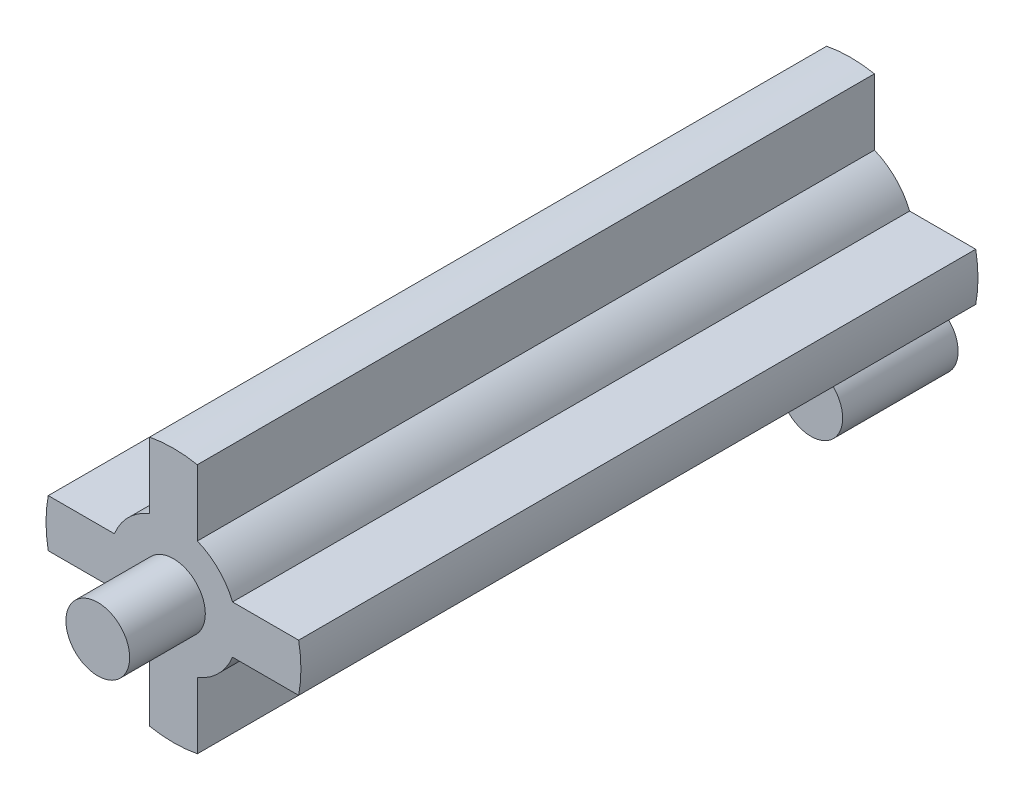
ISO-10303-21;
HEADER;
FILE_DESCRIPTION(('STEP AP214'),'2;1');
FILE_NAME('part.step','',(''),(''),'','','');
FILE_SCHEMA(('AUTOMOTIVE_DESIGN { 1 0 10303 214 1 1 1 1 }'));
ENDSEC;
DATA;
#1=APPLICATION_CONTEXT('core data for automotive mechanical design processes');
#2=APPLICATION_PROTOCOL_DEFINITION('international standard','automotive_design',2000,#1);
#3=PRODUCT_CONTEXT('',#1,'mechanical');
#4=PRODUCT('Part','Part','',(#3));
#5=PRODUCT_RELATED_PRODUCT_CATEGORY('part','',(#4));
#6=PRODUCT_DEFINITION_FORMATION('','',#4);
#7=PRODUCT_DEFINITION_CONTEXT('part definition',#1,'design');
#8=PRODUCT_DEFINITION('design','',#6,#7);
#9=PRODUCT_DEFINITION_SHAPE('','',#8);
#10=(LENGTH_UNIT() NAMED_UNIT(*) SI_UNIT(.MILLI.,.METRE.));
#11=(NAMED_UNIT(*) PLANE_ANGLE_UNIT() SI_UNIT($,.RADIAN.));
#12=(NAMED_UNIT(*) SI_UNIT($,.STERADIAN.) SOLID_ANGLE_UNIT());
#13=UNCERTAINTY_MEASURE_WITH_UNIT(LENGTH_MEASURE(1.E-05),#10,'distance_accuracy_value','');
#14=(GEOMETRIC_REPRESENTATION_CONTEXT(3) GLOBAL_UNCERTAINTY_ASSIGNED_CONTEXT((#13)) GLOBAL_UNIT_ASSIGNED_CONTEXT((#10,
#11,#12)) REPRESENTATION_CONTEXT('',''));
#15=CARTESIAN_POINT('',(0.,0.,0.));
#16=DIRECTION('',(0.,0.,1.));
#17=DIRECTION('',(1.,0.,0.));
#18=AXIS2_PLACEMENT_3D('',#15,#16,#17);
#19=CARTESIAN_POINT('',(9.53294491023637,-9.21867200110799,14.5));
#20=DIRECTION('',(0.,0.,-1.));
#21=DIRECTION('',(-1.,0.,0.));
#22=AXIS2_PLACEMENT_3D('',#19,#20,#21);
#23=CYLINDRICAL_SURFACE('',#22,3.975);
#24=CARTESIAN_POINT('',(9.53294491023637,-9.21867200110799,14.5));
#25=DIRECTION('',(0.,0.,1.));
#26=DIRECTION('',(1.,0.,0.));
#27=AXIS2_PLACEMENT_3D('',#24,#25,#26);
#28=CIRCLE('',#27,3.975);
#29=CARTESIAN_POINT('',(13.5079449102364,-9.21867200110799,14.5));
#30=VERTEX_POINT('',#29);
#31=EDGE_CURVE('E12',#30,#30,#28,.T.);
#32=ORIENTED_EDGE('',*,*,#31,.F.);
#33=EDGE_LOOP('',(#32));
#34=FACE_BOUND('',#33,.T.);
#35=CARTESIAN_POINT('',(9.53294491023637,-9.21867200110799,0.));
#36=DIRECTION('',(0.,0.,1.));
#37=DIRECTION('',(1.,0.,0.));
#38=AXIS2_PLACEMENT_3D('',#35,#36,#37);
#39=CIRCLE('',#38,3.975);
#40=CARTESIAN_POINT('',(13.5079449102364,-9.21867200110799,0.));
#41=VERTEX_POINT('',#40);
#42=EDGE_CURVE('E47',#41,#41,#39,.T.);
#43=ORIENTED_EDGE('',*,*,#42,.T.);
#44=EDGE_LOOP('',(#43));
#45=FACE_BOUND('',#44,.T.);
#46=ADVANCED_FACE('F44',(#34,#45),#23,.T.);
#47=CARTESIAN_POINT('',(9.53294491023637,-9.21867200110799,14.5));
#48=DIRECTION('',(0.,0.,1.));
#49=DIRECTION('',(1.,0.,0.));
#50=AXIS2_PLACEMENT_3D('',#47,#48,#49);
#51=PLANE('',#50);
#52=ORIENTED_EDGE('',*,*,#31,.T.);
#53=EDGE_LOOP('',(#52));
#54=FACE_BOUND('',#53,.T.);
#55=ADVANCED_FACE('F59',(#54),#51,.T.);
#56=CARTESIAN_POINT('',(9.53294491023637,-9.21867200110799,0.));
#57=DIRECTION('',(0.,0.,1.));
#58=DIRECTION('',(1.,0.,0.));
#59=AXIS2_PLACEMENT_3D('',#56,#57,#58);
#60=PLANE('',#59);
#61=ORIENTED_EDGE('',*,*,#42,.F.);
#62=EDGE_LOOP('',(#61));
#63=FACE_BOUND('',#62,.T.);
#64=ADVANCED_FACE('F57',(#63),#60,.F.);
#65=CLOSED_SHELL('',(#46,#55,#64));
#66=MANIFOLD_SOLID_BREP('B2',#65);
#67=CARTESIAN_POINT('',(0.,0.,85.));
#68=DIRECTION('',(0.,0.,-1.));
#69=DIRECTION('',(-1.,0.,0.));
#70=AXIS2_PLACEMENT_3D('',#67,#68,#69);
#71=CYLINDRICAL_SURFACE('',#70,16.);
#72=DIRECTION('',(0.,0.,-1.));
#73=VECTOR('',#72,1.);
#74=CARTESIAN_POINT('',(15.7162336455017,3.,85.));
#75=LINE('',#74,#73);
#76=CARTESIAN_POINT('',(15.7162336455017,3.,85.));
#77=VERTEX_POINT('',#76);
#78=CARTESIAN_POINT('',(15.7162336455017,3.,0.));
#79=VERTEX_POINT('',#78);
#80=EDGE_CURVE('E225',#77,#79,#75,.T.);
#81=ORIENTED_EDGE('',*,*,#80,.F.);
#82=CARTESIAN_POINT('',(0.,0.,85.));
#83=DIRECTION('',(0.,0.,1.));
#84=DIRECTION('',(1.,0.,0.));
#85=AXIS2_PLACEMENT_3D('',#82,#83,#84);
#86=CIRCLE('',#85,16.);
#87=CARTESIAN_POINT('',(15.7162336455017,-3.,85.));
#88=VERTEX_POINT('',#87);
#89=EDGE_CURVE('E218',#88,#77,#86,.T.);
#90=ORIENTED_EDGE('',*,*,#89,.F.);
#91=DIRECTION('',(0.,0.,-1.));
#92=VECTOR('',#91,1.);
#93=CARTESIAN_POINT('',(15.7162336455017,-3.,85.));
#94=LINE('',#93,#92);
#95=CARTESIAN_POINT('',(15.7162336455017,-3.,0.));
#96=VERTEX_POINT('',#95);
#97=EDGE_CURVE('E199',#88,#96,#94,.T.);
#98=ORIENTED_EDGE('',*,*,#97,.T.);
#99=CARTESIAN_POINT('',(0.,0.,0.));
#100=DIRECTION('',(0.,0.,1.));
#101=DIRECTION('',(1.,0.,0.));
#102=AXIS2_PLACEMENT_3D('',#99,#100,#101);
#103=CIRCLE('',#102,16.);
#104=EDGE_CURVE('E88',#96,#79,#103,.T.);
#105=ORIENTED_EDGE('',*,*,#104,.T.);
#106=EDGE_LOOP('',(#81,#90,#98,#105));
#107=FACE_BOUND('',#106,.T.);
#108=ADVANCED_FACE('F85',(#107),#71,.T.);
#109=DIRECTION('',(0.,0.,-1.));
#110=VECTOR('',#109,1.);
#111=CARTESIAN_POINT('',(3.,15.7162336455017,85.));
#112=LINE('',#111,#110);
#113=CARTESIAN_POINT('',(3.,15.7162336455017,85.));
#114=VERTEX_POINT('',#113);
#115=CARTESIAN_POINT('',(3.,15.7162336455017,0.));
#116=VERTEX_POINT('',#115);
#117=EDGE_CURVE('E292',#114,#116,#112,.T.);
#118=ORIENTED_EDGE('',*,*,#117,.T.);
#119=CARTESIAN_POINT('',(-3.,15.7162336455017,0.));
#120=VERTEX_POINT('',#119);
#121=EDGE_CURVE('E227',#116,#120,#103,.T.);
#122=ORIENTED_EDGE('',*,*,#121,.T.);
#123=DIRECTION('',(0.,0.,-1.));
#124=VECTOR('',#123,1.);
#125=CARTESIAN_POINT('',(-3.,15.7162336455017,85.));
#126=LINE('',#125,#124);
#127=CARTESIAN_POINT('',(-3.,15.7162336455017,85.));
#128=VERTEX_POINT('',#127);
#129=EDGE_CURVE('E295',#128,#120,#126,.T.);
#130=ORIENTED_EDGE('',*,*,#129,.F.);
#131=EDGE_CURVE('E93',#114,#128,#86,.T.);
#132=ORIENTED_EDGE('',*,*,#131,.F.);
#133=EDGE_LOOP('',(#118,#122,#130,#132));
#134=FACE_BOUND('',#133,.T.);
#135=ADVANCED_FACE('F382',(#134),#71,.T.);
#136=DIRECTION('',(0.,0.,-1.));
#137=VECTOR('',#136,1.);
#138=CARTESIAN_POINT('',(-15.7162336455017,3.,85.));
#139=LINE('',#138,#137);
#140=CARTESIAN_POINT('',(-15.7162336455017,3.,85.));
#141=VERTEX_POINT('',#140);
#142=CARTESIAN_POINT('',(-15.7162336455017,3.,0.));
#143=VERTEX_POINT('',#142);
#144=EDGE_CURVE('E251',#141,#143,#139,.T.);
#145=ORIENTED_EDGE('',*,*,#144,.T.);
#146=CARTESIAN_POINT('',(-15.7162336455017,-3.00000000000001,0.));
#147=VERTEX_POINT('',#146);
#148=EDGE_CURVE('E231',#143,#147,#103,.T.);
#149=ORIENTED_EDGE('',*,*,#148,.T.);
#150=DIRECTION('',(0.,0.,-1.));
#151=VECTOR('',#150,1.);
#152=CARTESIAN_POINT('',(-15.7162336455017,-3.00000000000001,85.));
#153=LINE('',#152,#151);
#154=CARTESIAN_POINT('',(-15.7162336455017,-3.00000000000001,85.));
#155=VERTEX_POINT('',#154);
#156=EDGE_CURVE('E253',#155,#147,#153,.T.);
#157=ORIENTED_EDGE('',*,*,#156,.F.);
#158=EDGE_CURVE('E229',#141,#155,#86,.T.);
#159=ORIENTED_EDGE('',*,*,#158,.F.);
#160=EDGE_LOOP('',(#145,#149,#157,#159));
#161=FACE_BOUND('',#160,.T.);
#162=ADVANCED_FACE('F249',(#161),#71,.T.);
#163=DIRECTION('',(0.,0.,-1.));
#164=VECTOR('',#163,1.);
#165=CARTESIAN_POINT('',(-3.,-15.7162336455017,85.));
#166=LINE('',#165,#164);
#167=CARTESIAN_POINT('',(-3.,-15.7162336455017,85.));
#168=VERTEX_POINT('',#167);
#169=CARTESIAN_POINT('',(-3.,-15.7162336455017,0.));
#170=VERTEX_POINT('',#169);
#171=EDGE_CURVE('E267',#168,#170,#166,.T.);
#172=ORIENTED_EDGE('',*,*,#171,.T.);
#173=CARTESIAN_POINT('',(3.,-15.7162336455017,0.));
#174=VERTEX_POINT('',#173);
#175=EDGE_CURVE('E317',#170,#174,#103,.T.);
#176=ORIENTED_EDGE('',*,*,#175,.T.);
#177=DIRECTION('',(0.,0.,-1.));
#178=VECTOR('',#177,1.);
#179=CARTESIAN_POINT('',(3.,-15.7162336455017,85.));
#180=LINE('',#179,#178);
#181=CARTESIAN_POINT('',(3.,-15.7162336455017,85.));
#182=VERTEX_POINT('',#181);
#183=EDGE_CURVE('E270',#182,#174,#180,.T.);
#184=ORIENTED_EDGE('',*,*,#183,.F.);
#185=EDGE_CURVE('E226',#168,#182,#86,.T.);
#186=ORIENTED_EDGE('',*,*,#185,.F.);
#187=EDGE_LOOP('',(#172,#176,#184,#186));
#188=FACE_BOUND('',#187,.T.);
#189=ADVANCED_FACE('F322',(#188),#71,.T.);
#190=CARTESIAN_POINT('',(0.,0.,85.));
#191=DIRECTION('',(0.,0.,1.));
#192=DIRECTION('',(1.,0.,0.));
#193=AXIS2_PLACEMENT_3D('',#190,#191,#192);
#194=PLANE('',#193);
#195=CARTESIAN_POINT('',(0.,0.,85.));
#196=DIRECTION('',(0.,0.,1.));
#197=DIRECTION('',(1.,0.,0.));
#198=AXIS2_PLACEMENT_3D('',#195,#196,#197);
#199=CIRCLE('',#198,4.);
#200=CARTESIAN_POINT('',(4.,0.,85.));
#201=VERTEX_POINT('',#200);
#202=EDGE_CURVE('E42',#201,#201,#199,.T.);
#203=ORIENTED_EDGE('',*,*,#202,.F.);
#204=EDGE_LOOP('',(#203));
#205=FACE_BOUND('',#204,.T.);
#206=ORIENTED_EDGE('',*,*,#89,.T.);
#207=DIRECTION('',(1.,0.,0.));
#208=VECTOR('',#207,1.);
#209=CARTESIAN_POINT('',(15.7162336455017,3.,85.));
#210=LINE('',#209,#208);
#211=CARTESIAN_POINT('',(7.41619848709566,3.,85.));
#212=VERTEX_POINT('',#211);
#213=EDGE_CURVE('E212',#212,#77,#210,.T.);
#214=ORIENTED_EDGE('',*,*,#213,.F.);
#215=CARTESIAN_POINT('',(0.,0.,85.));
#216=DIRECTION('',(0.,0.,-1.));
#217=DIRECTION('',(-1.,0.,0.));
#218=AXIS2_PLACEMENT_3D('',#215,#216,#217);
#219=CIRCLE('',#218,8.);
#220=CARTESIAN_POINT('',(3.,7.41619848709566,85.));
#221=VERTEX_POINT('',#220);
#222=EDGE_CURVE('E360',#221,#212,#219,.T.);
#223=ORIENTED_EDGE('',*,*,#222,.F.);
#224=DIRECTION('',(0.,-1.,0.));
#225=VECTOR('',#224,1.);
#226=CARTESIAN_POINT('',(3.,7.41619848709566,85.));
#227=LINE('',#226,#225);
#228=EDGE_CURVE('E357',#114,#221,#227,.T.);
#229=ORIENTED_EDGE('',*,*,#228,.F.);
#230=ORIENTED_EDGE('',*,*,#131,.T.);
#231=DIRECTION('',(0.,1.,0.));
#232=VECTOR('',#231,1.);
#233=CARTESIAN_POINT('',(-3.,15.7162336455017,85.));
#234=LINE('',#233,#232);
#235=CARTESIAN_POINT('',(-3.,7.41619848709566,85.));
#236=VERTEX_POINT('',#235);
#237=EDGE_CURVE('E355',#236,#128,#234,.T.);
#238=ORIENTED_EDGE('',*,*,#237,.F.);
#239=CARTESIAN_POINT('',(0.,0.,85.));
#240=DIRECTION('',(0.,0.,-1.));
#241=DIRECTION('',(-1.,0.,0.));
#242=AXIS2_PLACEMENT_3D('',#239,#240,#241);
#243=CIRCLE('',#242,8.);
#244=CARTESIAN_POINT('',(-7.41619848709566,3.,85.));
#245=VERTEX_POINT('',#244);
#246=EDGE_CURVE('E353',#245,#236,#243,.T.);
#247=ORIENTED_EDGE('',*,*,#246,.F.);
#248=DIRECTION('',(1.,0.,0.));
#249=VECTOR('',#248,1.);
#250=CARTESIAN_POINT('',(-7.41619848709566,3.,85.));
#251=LINE('',#250,#249);
#252=EDGE_CURVE('E245',#141,#245,#251,.T.);
#253=ORIENTED_EDGE('',*,*,#252,.F.);
#254=ORIENTED_EDGE('',*,*,#158,.T.);
#255=DIRECTION('',(-1.,0.,0.));
#256=VECTOR('',#255,1.);
#257=CARTESIAN_POINT('',(-15.7162336455017,-3.,85.));
#258=LINE('',#257,#256);
#259=CARTESIAN_POINT('',(-7.41619848709566,-3.,85.));
#260=VERTEX_POINT('',#259);
#261=EDGE_CURVE('E242',#260,#155,#258,.T.);
#262=ORIENTED_EDGE('',*,*,#261,.F.);
#263=CARTESIAN_POINT('',(0.,0.,85.));
#264=DIRECTION('',(0.,0.,-1.));
#265=DIRECTION('',(-1.,0.,0.));
#266=AXIS2_PLACEMENT_3D('',#263,#264,#265);
#267=CIRCLE('',#266,8.);
#268=CARTESIAN_POINT('',(-3.,-7.41619848709566,85.));
#269=VERTEX_POINT('',#268);
#270=EDGE_CURVE('E345',#269,#260,#267,.T.);
#271=ORIENTED_EDGE('',*,*,#270,.F.);
#272=DIRECTION('',(0.,1.,0.));
#273=VECTOR('',#272,1.);
#274=CARTESIAN_POINT('',(-3.,-15.7162336455017,85.));
#275=LINE('',#274,#273);
#276=EDGE_CURVE('E344',#168,#269,#275,.T.);
#277=ORIENTED_EDGE('',*,*,#276,.F.);
#278=ORIENTED_EDGE('',*,*,#185,.T.);
#279=DIRECTION('',(0.,-1.,0.));
#280=VECTOR('',#279,1.);
#281=CARTESIAN_POINT('',(3.,-7.41619848709566,85.));
#282=LINE('',#281,#280);
#283=CARTESIAN_POINT('',(3.,-7.41619848709566,85.));
#284=VERTEX_POINT('',#283);
#285=EDGE_CURVE('E346',#284,#182,#282,.T.);
#286=ORIENTED_EDGE('',*,*,#285,.F.);
#287=CARTESIAN_POINT('',(0.,0.,85.));
#288=DIRECTION('',(0.,0.,-1.));
#289=DIRECTION('',(-1.,0.,0.));
#290=AXIS2_PLACEMENT_3D('',#287,#288,#289);
#291=CIRCLE('',#290,8.);
#292=CARTESIAN_POINT('',(7.41619848709566,-3.,85.));
#293=VERTEX_POINT('',#292);
#294=EDGE_CURVE('E221',#293,#284,#291,.T.);
#295=ORIENTED_EDGE('',*,*,#294,.F.);
#296=DIRECTION('',(-1.,0.,0.));
#297=VECTOR('',#296,1.);
#298=CARTESIAN_POINT('',(7.41619848709566,-3.,85.));
#299=LINE('',#298,#297);
#300=EDGE_CURVE('E203',#88,#293,#299,.T.);
#301=ORIENTED_EDGE('',*,*,#300,.F.);
#302=EDGE_LOOP('',(#206,#214,#223,#229,#230,#238,#247,#253,#254,#262,#271,#277,#278,#286,#295,#301));
#303=FACE_BOUND('',#302,.T.);
#304=ADVANCED_FACE('F216',(#205,#303),#194,.T.);
#305=CARTESIAN_POINT('',(0.,0.,0.));
#306=DIRECTION('',(0.,0.,1.));
#307=DIRECTION('',(1.,0.,0.));
#308=AXIS2_PLACEMENT_3D('',#305,#306,#307);
#309=PLANE('',#308);
#310=CARTESIAN_POINT('',(0.,0.,0.));
#311=DIRECTION('',(0.,0.,-1.));
#312=DIRECTION('',(-1.,0.,0.));
#313=AXIS2_PLACEMENT_3D('',#310,#311,#312);
#314=CIRCLE('',#313,4.);
#315=CARTESIAN_POINT('',(-4.,0.,0.));
#316=VERTEX_POINT('',#315);
#317=EDGE_CURVE('E277',#316,#316,#314,.T.);
#318=ORIENTED_EDGE('',*,*,#317,.F.);
#319=EDGE_LOOP('',(#318));
#320=FACE_BOUND('',#319,.T.);
#321=DIRECTION('',(1.,0.,0.));
#322=VECTOR('',#321,1.);
#323=CARTESIAN_POINT('',(15.7162336455017,3.,0.));
#324=LINE('',#323,#322);
#325=CARTESIAN_POINT('',(7.41619848709566,3.,0.));
#326=VERTEX_POINT('',#325);
#327=EDGE_CURVE('E222',#326,#79,#324,.T.);
#328=ORIENTED_EDGE('',*,*,#327,.T.);
#329=ORIENTED_EDGE('',*,*,#104,.F.);
#330=DIRECTION('',(-1.,0.,0.));
#331=VECTOR('',#330,1.);
#332=CARTESIAN_POINT('',(7.41619848709566,-3.,0.));
#333=LINE('',#332,#331);
#334=CARTESIAN_POINT('',(7.41619848709566,-3.,0.));
#335=VERTEX_POINT('',#334);
#336=EDGE_CURVE('E206',#96,#335,#333,.T.);
#337=ORIENTED_EDGE('',*,*,#336,.T.);
#338=CARTESIAN_POINT('',(0.,0.,0.));
#339=DIRECTION('',(0.,0.,-1.));
#340=DIRECTION('',(-1.,0.,0.));
#341=AXIS2_PLACEMENT_3D('',#338,#339,#340);
#342=CIRCLE('',#341,8.);
#343=CARTESIAN_POINT('',(3.,-7.41619848709566,0.));
#344=VERTEX_POINT('',#343);
#345=EDGE_CURVE('E331',#335,#344,#342,.T.);
#346=ORIENTED_EDGE('',*,*,#345,.T.);
#347=DIRECTION('',(0.,-1.,0.));
#348=VECTOR('',#347,1.);
#349=CARTESIAN_POINT('',(3.,-7.41619848709566,0.));
#350=LINE('',#349,#348);
#351=EDGE_CURVE('E330',#344,#174,#350,.T.);
#352=ORIENTED_EDGE('',*,*,#351,.T.);
#353=ORIENTED_EDGE('',*,*,#175,.F.);
#354=DIRECTION('',(0.,1.,0.));
#355=VECTOR('',#354,1.);
#356=CARTESIAN_POINT('',(-3.,-15.7162336455017,0.));
#357=LINE('',#356,#355);
#358=CARTESIAN_POINT('',(-3.,-7.41619848709566,0.));
#359=VERTEX_POINT('',#358);
#360=EDGE_CURVE('E327',#170,#359,#357,.T.);
#361=ORIENTED_EDGE('',*,*,#360,.T.);
#362=CARTESIAN_POINT('',(0.,0.,0.));
#363=DIRECTION('',(0.,0.,-1.));
#364=DIRECTION('',(-1.,0.,0.));
#365=AXIS2_PLACEMENT_3D('',#362,#363,#364);
#366=CIRCLE('',#365,8.);
#367=CARTESIAN_POINT('',(-7.41619848709566,-3.,0.));
#368=VERTEX_POINT('',#367);
#369=EDGE_CURVE('E310',#359,#368,#366,.T.);
#370=ORIENTED_EDGE('',*,*,#369,.T.);
#371=DIRECTION('',(-1.,0.,0.));
#372=VECTOR('',#371,1.);
#373=CARTESIAN_POINT('',(-15.7162336455017,-3.,0.));
#374=LINE('',#373,#372);
#375=EDGE_CURVE('E306',#368,#147,#374,.T.);
#376=ORIENTED_EDGE('',*,*,#375,.T.);
#377=ORIENTED_EDGE('',*,*,#148,.F.);
#378=DIRECTION('',(1.,0.,0.));
#379=VECTOR('',#378,1.);
#380=CARTESIAN_POINT('',(-7.41619848709566,3.,0.));
#381=LINE('',#380,#379);
#382=CARTESIAN_POINT('',(-7.41619848709566,3.,0.));
#383=VERTEX_POINT('',#382);
#384=EDGE_CURVE('E301',#143,#383,#381,.T.);
#385=ORIENTED_EDGE('',*,*,#384,.T.);
#386=CARTESIAN_POINT('',(0.,0.,0.));
#387=DIRECTION('',(0.,0.,-1.));
#388=DIRECTION('',(-1.,0.,0.));
#389=AXIS2_PLACEMENT_3D('',#386,#387,#388);
#390=CIRCLE('',#389,8.);
#391=CARTESIAN_POINT('',(-3.,7.41619848709566,0.));
#392=VERTEX_POINT('',#391);
#393=EDGE_CURVE('E109',#383,#392,#390,.T.);
#394=ORIENTED_EDGE('',*,*,#393,.T.);
#395=DIRECTION('',(0.,1.,0.));
#396=VECTOR('',#395,1.);
#397=CARTESIAN_POINT('',(-3.,15.7162336455017,0.));
#398=LINE('',#397,#396);
#399=EDGE_CURVE('E308',#392,#120,#398,.T.);
#400=ORIENTED_EDGE('',*,*,#399,.T.);
#401=ORIENTED_EDGE('',*,*,#121,.F.);
#402=DIRECTION('',(0.,-1.,0.));
#403=VECTOR('',#402,1.);
#404=CARTESIAN_POINT('',(3.,7.41619848709566,0.));
#405=LINE('',#404,#403);
#406=CARTESIAN_POINT('',(3.,7.41619848709566,0.));
#407=VERTEX_POINT('',#406);
#408=EDGE_CURVE('E315',#116,#407,#405,.T.);
#409=ORIENTED_EDGE('',*,*,#408,.T.);
#410=CARTESIAN_POINT('',(0.,0.,0.));
#411=DIRECTION('',(0.,0.,-1.));
#412=DIRECTION('',(-1.,0.,0.));
#413=AXIS2_PLACEMENT_3D('',#410,#411,#412);
#414=CIRCLE('',#413,8.);
#415=EDGE_CURVE('E101',#407,#326,#414,.T.);
#416=ORIENTED_EDGE('',*,*,#415,.T.);
#417=EDGE_LOOP('',(#328,#329,#337,#346,#352,#353,#361,#370,#376,#377,#385,#394,#400,#401,#409,#416));
#418=FACE_BOUND('',#417,.T.);
#419=ADVANCED_FACE('F304',(#320,#418),#309,.F.);
#420=CARTESIAN_POINT('',(0.,0.,5.));
#421=DIRECTION('',(0.,0.,-1.));
#422=DIRECTION('',(-1.,0.,0.));
#423=AXIS2_PLACEMENT_3D('',#420,#421,#422);
#424=CYLINDRICAL_SURFACE('',#423,4.);
#425=CARTESIAN_POINT('',(0.,0.,5.));
#426=DIRECTION('',(0.,0.,-1.));
#427=DIRECTION('',(-1.,0.,0.));
#428=AXIS2_PLACEMENT_3D('',#425,#426,#427);
#429=CIRCLE('',#428,4.);
#430=CARTESIAN_POINT('',(-4.,0.,5.));
#431=VERTEX_POINT('',#430);
#432=EDGE_CURVE('E275',#431,#431,#429,.T.);
#433=ORIENTED_EDGE('',*,*,#432,.F.);
#434=EDGE_LOOP('',(#433));
#435=FACE_BOUND('',#434,.T.);
#436=ORIENTED_EDGE('',*,*,#317,.T.);
#437=EDGE_LOOP('',(#436));
#438=FACE_BOUND('',#437,.T.);
#439=ADVANCED_FACE('F414',(#435,#438),#424,.F.);
#440=CARTESIAN_POINT('',(0.,0.,5.));
#441=DIRECTION('',(0.,0.,-1.));
#442=DIRECTION('',(-1.,0.,0.));
#443=AXIS2_PLACEMENT_3D('',#440,#441,#442);
#444=PLANE('',#443);
#445=ORIENTED_EDGE('',*,*,#432,.T.);
#446=EDGE_LOOP('',(#445));
#447=FACE_BOUND('',#446,.T.);
#448=ADVANCED_FACE('F379',(#447),#444,.T.);
#449=CARTESIAN_POINT('',(7.41619848709566,-3.,85.));
#450=DIRECTION('',(0.,-1.,0.));
#451=DIRECTION('',(0.,0.,-1.));
#452=AXIS2_PLACEMENT_3D('',#449,#450,#451);
#453=PLANE('',#452);
#454=ORIENTED_EDGE('',*,*,#336,.F.);
#455=ORIENTED_EDGE('',*,*,#97,.F.);
#456=ORIENTED_EDGE('',*,*,#300,.T.);
#457=DIRECTION('',(0.,0.,-1.));
#458=VECTOR('',#457,1.);
#459=CARTESIAN_POINT('',(7.41619848709566,-3.,85.));
#460=LINE('',#459,#458);
#461=EDGE_CURVE('E211',#293,#335,#460,.T.);
#462=ORIENTED_EDGE('',*,*,#461,.T.);
#463=EDGE_LOOP('',(#454,#455,#456,#462));
#464=FACE_BOUND('',#463,.T.);
#465=ADVANCED_FACE('F201',(#464),#453,.T.);
#466=CARTESIAN_POINT('',(0.,0.,85.));
#467=DIRECTION('',(0.,0.,-1.));
#468=DIRECTION('',(-1.,0.,0.));
#469=AXIS2_PLACEMENT_3D('',#466,#467,#468);
#470=CYLINDRICAL_SURFACE('',#469,8.);
#471=ORIENTED_EDGE('',*,*,#345,.F.);
#472=ORIENTED_EDGE('',*,*,#461,.F.);
#473=ORIENTED_EDGE('',*,*,#294,.T.);
#474=DIRECTION('',(0.,0.,-1.));
#475=VECTOR('',#474,1.);
#476=CARTESIAN_POINT('',(3.,-7.41619848709566,85.));
#477=LINE('',#476,#475);
#478=EDGE_CURVE('E272',#284,#344,#477,.T.);
#479=ORIENTED_EDGE('',*,*,#478,.T.);
#480=EDGE_LOOP('',(#471,#472,#473,#479));
#481=FACE_BOUND('',#480,.T.);
#482=ADVANCED_FACE('F371',(#481),#470,.T.);
#483=CARTESIAN_POINT('',(3.,-7.41619848709566,85.));
#484=DIRECTION('',(1.,0.,0.));
#485=DIRECTION('',(0.,0.,-1.));
#486=AXIS2_PLACEMENT_3D('',#483,#484,#485);
#487=PLANE('',#486);
#488=ORIENTED_EDGE('',*,*,#351,.F.);
#489=ORIENTED_EDGE('',*,*,#478,.F.);
#490=ORIENTED_EDGE('',*,*,#285,.T.);
#491=ORIENTED_EDGE('',*,*,#183,.T.);
#492=EDGE_LOOP('',(#488,#489,#490,#491));
#493=FACE_BOUND('',#492,.T.);
#494=ADVANCED_FACE('F369',(#493),#487,.T.);
#495=CARTESIAN_POINT('',(-3.,-15.7162336455017,85.));
#496=DIRECTION('',(-1.,0.,0.));
#497=DIRECTION('',(0.,0.,1.));
#498=AXIS2_PLACEMENT_3D('',#495,#496,#497);
#499=PLANE('',#498);
#500=ORIENTED_EDGE('',*,*,#360,.F.);
#501=ORIENTED_EDGE('',*,*,#171,.F.);
#502=ORIENTED_EDGE('',*,*,#276,.T.);
#503=DIRECTION('',(0.,0.,-1.));
#504=VECTOR('',#503,1.);
#505=CARTESIAN_POINT('',(-3.,-7.41619848709566,85.));
#506=LINE('',#505,#504);
#507=EDGE_CURVE('E261',#269,#359,#506,.T.);
#508=ORIENTED_EDGE('',*,*,#507,.T.);
#509=EDGE_LOOP('',(#500,#501,#502,#508));
#510=FACE_BOUND('',#509,.T.);
#511=ADVANCED_FACE('F342',(#510),#499,.T.);
#512=CARTESIAN_POINT('',(0.,0.,85.));
#513=DIRECTION('',(0.,0.,-1.));
#514=DIRECTION('',(-1.,0.,0.));
#515=AXIS2_PLACEMENT_3D('',#512,#513,#514);
#516=CYLINDRICAL_SURFACE('',#515,8.);
#517=ORIENTED_EDGE('',*,*,#369,.F.);
#518=ORIENTED_EDGE('',*,*,#507,.F.);
#519=ORIENTED_EDGE('',*,*,#270,.T.);
#520=DIRECTION('',(0.,0.,-1.));
#521=VECTOR('',#520,1.);
#522=CARTESIAN_POINT('',(-7.41619848709566,-3.,85.));
#523=LINE('',#522,#521);
#524=EDGE_CURVE('E257',#260,#368,#523,.T.);
#525=ORIENTED_EDGE('',*,*,#524,.T.);
#526=EDGE_LOOP('',(#517,#518,#519,#525));
#527=FACE_BOUND('',#526,.T.);
#528=ADVANCED_FACE('F338',(#527),#516,.T.);
#529=CARTESIAN_POINT('',(-15.7162336455017,-3.,85.));
#530=DIRECTION('',(0.,-1.,0.));
#531=DIRECTION('',(1.,0.,0.));
#532=AXIS2_PLACEMENT_3D('',#529,#530,#531);
#533=PLANE('',#532);
#534=ORIENTED_EDGE('',*,*,#375,.F.);
#535=ORIENTED_EDGE('',*,*,#524,.F.);
#536=ORIENTED_EDGE('',*,*,#261,.T.);
#537=ORIENTED_EDGE('',*,*,#156,.T.);
#538=EDGE_LOOP('',(#534,#535,#536,#537));
#539=FACE_BOUND('',#538,.T.);
#540=ADVANCED_FACE('F485',(#539),#533,.T.);
#541=CARTESIAN_POINT('',(-7.41619848709566,3.,85.));
#542=DIRECTION('',(0.,1.,0.));
#543=DIRECTION('',(0.,0.,1.));
#544=AXIS2_PLACEMENT_3D('',#541,#542,#543);
#545=PLANE('',#544);
#546=ORIENTED_EDGE('',*,*,#384,.F.);
#547=ORIENTED_EDGE('',*,*,#144,.F.);
#548=ORIENTED_EDGE('',*,*,#252,.T.);
#549=DIRECTION('',(0.,0.,-1.));
#550=VECTOR('',#549,1.);
#551=CARTESIAN_POINT('',(-7.41619848709566,3.,85.));
#552=LINE('',#551,#550);
#553=EDGE_CURVE('E259',#245,#383,#552,.T.);
#554=ORIENTED_EDGE('',*,*,#553,.T.);
#555=EDGE_LOOP('',(#546,#547,#548,#554));
#556=FACE_BOUND('',#555,.T.);
#557=ADVANCED_FACE('F300',(#556),#545,.T.);
#558=CARTESIAN_POINT('',(0.,0.,85.));
#559=DIRECTION('',(0.,0.,-1.));
#560=DIRECTION('',(-1.,0.,0.));
#561=AXIS2_PLACEMENT_3D('',#558,#559,#560);
#562=CYLINDRICAL_SURFACE('',#561,8.);
#563=ORIENTED_EDGE('',*,*,#393,.F.);
#564=ORIENTED_EDGE('',*,*,#553,.F.);
#565=ORIENTED_EDGE('',*,*,#246,.T.);
#566=DIRECTION('',(0.,0.,-1.));
#567=VECTOR('',#566,1.);
#568=CARTESIAN_POINT('',(-3.,7.41619848709566,85.));
#569=LINE('',#568,#567);
#570=EDGE_CURVE('E297',#236,#392,#569,.T.);
#571=ORIENTED_EDGE('',*,*,#570,.T.);
#572=EDGE_LOOP('',(#563,#564,#565,#571));
#573=FACE_BOUND('',#572,.T.);
#574=ADVANCED_FACE('F479',(#573),#562,.T.);
#575=CARTESIAN_POINT('',(-3.,15.7162336455017,85.));
#576=DIRECTION('',(-1.,0.,0.));
#577=DIRECTION('',(0.,-1.,0.));
#578=AXIS2_PLACEMENT_3D('',#575,#576,#577);
#579=PLANE('',#578);
#580=ORIENTED_EDGE('',*,*,#399,.F.);
#581=ORIENTED_EDGE('',*,*,#570,.F.);
#582=ORIENTED_EDGE('',*,*,#237,.T.);
#583=ORIENTED_EDGE('',*,*,#129,.T.);
#584=EDGE_LOOP('',(#580,#581,#582,#583));
#585=FACE_BOUND('',#584,.T.);
#586=ADVANCED_FACE('F472',(#585),#579,.T.);
#587=CARTESIAN_POINT('',(15.7162336455017,3.,85.));
#588=DIRECTION('',(0.,1.,0.));
#589=DIRECTION('',(0.,0.,1.));
#590=AXIS2_PLACEMENT_3D('',#587,#588,#589);
#591=PLANE('',#590);
#592=ORIENTED_EDGE('',*,*,#327,.F.);
#593=DIRECTION('',(0.,0.,-1.));
#594=VECTOR('',#593,1.);
#595=CARTESIAN_POINT('',(7.41619848709566,3.,85.));
#596=LINE('',#595,#594);
#597=EDGE_CURVE('E281',#212,#326,#596,.T.);
#598=ORIENTED_EDGE('',*,*,#597,.F.);
#599=ORIENTED_EDGE('',*,*,#213,.T.);
#600=ORIENTED_EDGE('',*,*,#80,.T.);
#601=EDGE_LOOP('',(#592,#598,#599,#600));
#602=FACE_BOUND('',#601,.T.);
#603=ADVANCED_FACE('F468',(#602),#591,.T.);
#604=CARTESIAN_POINT('',(0.,0.,85.));
#605=DIRECTION('',(0.,0.,-1.));
#606=DIRECTION('',(-1.,0.,0.));
#607=AXIS2_PLACEMENT_3D('',#604,#605,#606);
#608=CYLINDRICAL_SURFACE('',#607,8.);
#609=ORIENTED_EDGE('',*,*,#415,.F.);
#610=DIRECTION('',(0.,0.,-1.));
#611=VECTOR('',#610,1.);
#612=CARTESIAN_POINT('',(3.,7.41619848709566,85.));
#613=LINE('',#612,#611);
#614=EDGE_CURVE('E286',#221,#407,#613,.T.);
#615=ORIENTED_EDGE('',*,*,#614,.F.);
#616=ORIENTED_EDGE('',*,*,#222,.T.);
#617=ORIENTED_EDGE('',*,*,#597,.T.);
#618=EDGE_LOOP('',(#609,#615,#616,#617));
#619=FACE_BOUND('',#618,.T.);
#620=ADVANCED_FACE('F471',(#619),#608,.T.);
#621=CARTESIAN_POINT('',(3.,7.41619848709566,85.));
#622=DIRECTION('',(1.,0.,0.));
#623=DIRECTION('',(0.,0.,-1.));
#624=AXIS2_PLACEMENT_3D('',#621,#622,#623);
#625=PLANE('',#624);
#626=ORIENTED_EDGE('',*,*,#408,.F.);
#627=ORIENTED_EDGE('',*,*,#117,.F.);
#628=ORIENTED_EDGE('',*,*,#228,.T.);
#629=ORIENTED_EDGE('',*,*,#614,.T.);
#630=EDGE_LOOP('',(#626,#627,#628,#629));
#631=FACE_BOUND('',#630,.T.);
#632=ADVANCED_FACE('F444',(#631),#625,.T.);
#633=CARTESIAN_POINT('',(0.,0.,94.5));
#634=DIRECTION('',(0.,0.,-1.));
#635=DIRECTION('',(-1.,0.,0.));
#636=AXIS2_PLACEMENT_3D('',#633,#634,#635);
#637=CYLINDRICAL_SURFACE('',#636,4.);
#638=CARTESIAN_POINT('',(0.,0.,94.5));
#639=DIRECTION('',(0.,0.,1.));
#640=DIRECTION('',(1.,0.,0.));
#641=AXIS2_PLACEMENT_3D('',#638,#639,#640);
#642=CIRCLE('',#641,4.);
#643=CARTESIAN_POINT('',(4.,0.,94.5));
#644=VERTEX_POINT('',#643);
#645=EDGE_CURVE('E363',#644,#644,#642,.T.);
#646=ORIENTED_EDGE('',*,*,#645,.F.);
#647=EDGE_LOOP('',(#646));
#648=FACE_BOUND('',#647,.T.);
#649=ORIENTED_EDGE('',*,*,#202,.T.);
#650=EDGE_LOOP('',(#649));
#651=FACE_BOUND('',#650,.T.);
#652=ADVANCED_FACE('F449',(#648,#651),#637,.T.);
#653=CARTESIAN_POINT('',(0.,0.,94.5));
#654=DIRECTION('',(0.,0.,1.));
#655=DIRECTION('',(1.,0.,0.));
#656=AXIS2_PLACEMENT_3D('',#653,#654,#655);
#657=PLANE('',#656);
#658=ORIENTED_EDGE('',*,*,#645,.T.);
#659=EDGE_LOOP('',(#658));
#660=FACE_BOUND('',#659,.T.);
#661=ADVANCED_FACE('F454',(#660),#657,.T.);
#662=CLOSED_SHELL('',(#108,#135,#162,#189,#304,#419,#439,#448,#465,#482,#494,#511,#528,#540,
#557,#574,#586,#603,#620,#632,#652,#661));
#663=MANIFOLD_SOLID_BREP('B7',#662);
#664=ADVANCED_BREP_SHAPE_REPRESENTATION('',(#18,#66,#663),#14);
#665=SHAPE_DEFINITION_REPRESENTATION(#9,#664);
ENDSEC;
END-ISO-10303-21;
